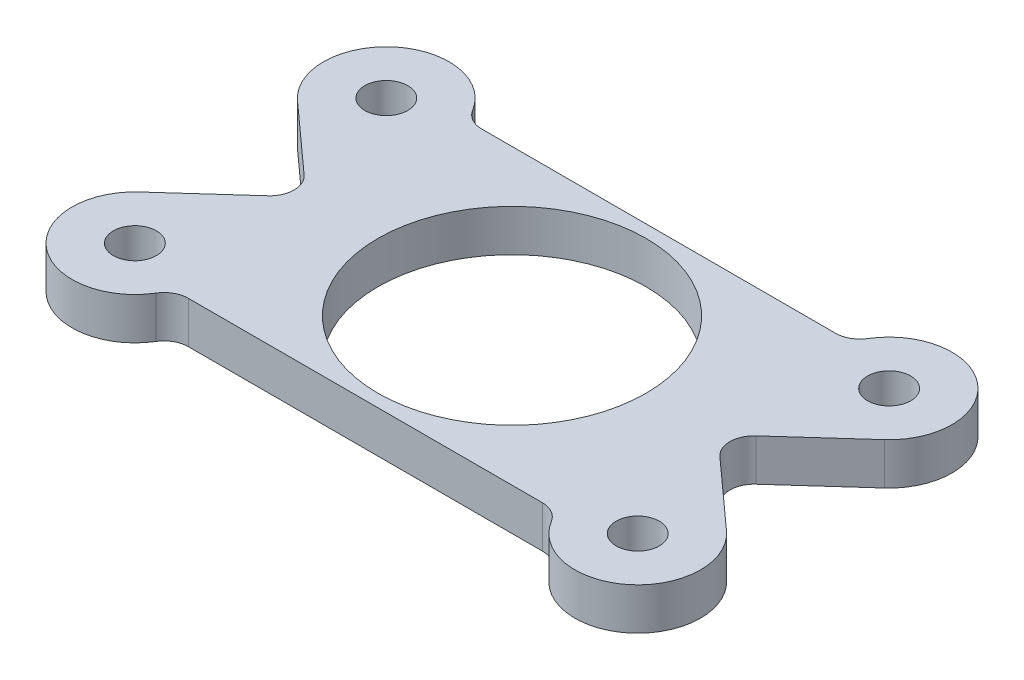
ISO-10303-21;
HEADER;
FILE_DESCRIPTION(('STEP AP214'),'2;1');
FILE_NAME('part.step','',(''),(''),'','','');
FILE_SCHEMA(('AUTOMOTIVE_DESIGN { 1 0 10303 214 1 1 1 1 }'));
ENDSEC;
DATA;
#1=APPLICATION_CONTEXT('core data for automotive mechanical design processes');
#2=APPLICATION_PROTOCOL_DEFINITION('international standard','automotive_design',2000,#1);
#3=PRODUCT_CONTEXT('',#1,'mechanical');
#4=PRODUCT('Part','Part','',(#3));
#5=PRODUCT_RELATED_PRODUCT_CATEGORY('part','',(#4));
#6=PRODUCT_DEFINITION_FORMATION('','',#4);
#7=PRODUCT_DEFINITION_CONTEXT('part definition',#1,'design');
#8=PRODUCT_DEFINITION('design','',#6,#7);
#9=PRODUCT_DEFINITION_SHAPE('','',#8);
#10=(LENGTH_UNIT() NAMED_UNIT(*) SI_UNIT(.MILLI.,.METRE.));
#11=(NAMED_UNIT(*) PLANE_ANGLE_UNIT() SI_UNIT($,.RADIAN.));
#12=(NAMED_UNIT(*) SI_UNIT($,.STERADIAN.) SOLID_ANGLE_UNIT());
#13=UNCERTAINTY_MEASURE_WITH_UNIT(LENGTH_MEASURE(1.E-05),#10,'distance_accuracy_value','');
#14=(GEOMETRIC_REPRESENTATION_CONTEXT(3) GLOBAL_UNCERTAINTY_ASSIGNED_CONTEXT((#13)) GLOBAL_UNIT_ASSIGNED_CONTEXT((#10,
#11,#12)) REPRESENTATION_CONTEXT('',''));
#15=CARTESIAN_POINT('',(0.,0.,0.));
#16=DIRECTION('',(0.,0.,1.));
#17=DIRECTION('',(1.,0.,0.));
#18=AXIS2_PLACEMENT_3D('',#15,#16,#17);
#19=CARTESIAN_POINT('',(19.05,3.175,-9.525));
#20=DIRECTION('',(0.,1.,0.));
#21=DIRECTION('',(0.,0.,1.));
#22=AXIS2_PLACEMENT_3D('',#19,#20,#21);
#23=PLANE('',#22);
#24=CARTESIAN_POINT('',(-19.05,3.175,-9.525));
#25=DIRECTION('',(0.,1.,0.));
#26=DIRECTION('',(0.,0.,1.));
#27=AXIS2_PLACEMENT_3D('',#24,#25,#26);
#28=CIRCLE('',#27,1.63194999999999);
#29=CARTESIAN_POINT('',(-19.05,3.175,-7.89305000000001));
#30=VERTEX_POINT('',#29);
#31=EDGE_CURVE('E393',#30,#30,#28,.T.);
#32=ORIENTED_EDGE('',*,*,#31,.F.);
#33=EDGE_LOOP('',(#32));
#34=FACE_BOUND('',#33,.T.);
#35=CARTESIAN_POINT('',(-19.05,3.175,9.525));
#36=DIRECTION('',(0.,1.,0.));
#37=DIRECTION('',(0.,0.,1.));
#38=AXIS2_PLACEMENT_3D('',#35,#36,#37);
#39=CIRCLE('',#38,1.63194999999999);
#40=CARTESIAN_POINT('',(-19.05,3.175,11.15695));
#41=VERTEX_POINT('',#40);
#42=EDGE_CURVE('E387',#41,#41,#39,.T.);
#43=ORIENTED_EDGE('',*,*,#42,.F.);
#44=EDGE_LOOP('',(#43));
#45=FACE_BOUND('',#44,.T.);
#46=CARTESIAN_POINT('',(19.05,3.175,9.525));
#47=DIRECTION('',(0.,1.,0.));
#48=DIRECTION('',(0.,0.,1.));
#49=AXIS2_PLACEMENT_3D('',#46,#47,#48);
#50=CIRCLE('',#49,1.63194999999999);
#51=CARTESIAN_POINT('',(19.05,3.175,11.15695));
#52=VERTEX_POINT('',#51);
#53=EDGE_CURVE('E381',#52,#52,#50,.T.);
#54=ORIENTED_EDGE('',*,*,#53,.F.);
#55=EDGE_LOOP('',(#54));
#56=FACE_BOUND('',#55,.T.);
#57=CARTESIAN_POINT('',(19.05,3.175,-9.525));
#58=DIRECTION('',(0.,1.,0.));
#59=DIRECTION('',(0.,0.,1.));
#60=AXIS2_PLACEMENT_3D('',#57,#58,#59);
#61=CIRCLE('',#60,1.63194999999999);
#62=CARTESIAN_POINT('',(19.05,3.175,-7.89305000000001));
#63=VERTEX_POINT('',#62);
#64=EDGE_CURVE('E375',#63,#63,#61,.T.);
#65=ORIENTED_EDGE('',*,*,#64,.F.);
#66=EDGE_LOOP('',(#65));
#67=FACE_BOUND('',#66,.T.);
#68=CARTESIAN_POINT('',(19.05,3.175,-9.525));
#69=DIRECTION('',(0.,1.,0.));
#70=DIRECTION('',(0.,0.,1.));
#71=AXIS2_PLACEMENT_3D('',#68,#69,#70);
#72=CIRCLE('',#71,4.7625);
#73=CARTESIAN_POINT('',(22.2403597223853,3.175,-5.98904028702507));
#74=VERTEX_POINT('',#73);
#75=CARTESIAN_POINT('',(14.9798052007245,3.175,-11.9978365384615));
#76=VERTEX_POINT('',#75);
#77=EDGE_CURVE('E217',#74,#76,#72,.T.);
#78=ORIENTED_EDGE('',*,*,#77,.T.);
#79=CARTESIAN_POINT('',(13.4059965450046,3.175,-12.954));
#80=DIRECTION('',(0.,1.,0.));
#81=DIRECTION('',(0.,0.,1.));
#82=AXIS2_PLACEMENT_3D('',#79,#80,#81);
#83=CIRCLE('',#82,1.8415);
#84=CARTESIAN_POINT('',(13.4059965450046,3.175,-11.1125));
#85=VERTEX_POINT('',#84);
#86=EDGE_CURVE('E264',#76,#85,#83,.F.);
#87=ORIENTED_EDGE('',*,*,#86,.T.);
#88=DIRECTION('',(-1.,0.,0.));
#89=VECTOR('',#88,1.);
#90=CARTESIAN_POINT('',(-14.5598719394654,3.175,-11.1125));
#91=LINE('',#90,#89);
#92=CARTESIAN_POINT('',(-13.4059965450046,3.175,-11.1125));
#93=VERTEX_POINT('',#92);
#94=EDGE_CURVE('E152',#85,#93,#91,.T.);
#95=ORIENTED_EDGE('',*,*,#94,.T.);
#96=CARTESIAN_POINT('',(-13.4059965450046,3.175,-12.954));
#97=DIRECTION('',(0.,1.,0.));
#98=DIRECTION('',(0.,0.,1.));
#99=AXIS2_PLACEMENT_3D('',#96,#97,#98);
#100=CIRCLE('',#99,1.8415);
#101=CARTESIAN_POINT('',(-14.9798052007245,3.175,-11.9978365384615));
#102=VERTEX_POINT('',#101);
#103=EDGE_CURVE('E11',#93,#102,#100,.F.);
#104=ORIENTED_EDGE('',*,*,#103,.T.);
#105=CARTESIAN_POINT('',(-19.05,3.175,-9.525));
#106=DIRECTION('',(0.,1.,0.));
#107=DIRECTION('',(0.,0.,1.));
#108=AXIS2_PLACEMENT_3D('',#105,#106,#107);
#109=CIRCLE('',#108,4.7625);
#110=CARTESIAN_POINT('',(-22.2403597223853,3.175,-5.98904028702507));
#111=VERTEX_POINT('',#110);
#112=EDGE_CURVE('E144',#102,#111,#109,.T.);
#113=ORIENTED_EDGE('',*,*,#112,.T.);
#114=DIRECTION('',(0.742458732383186,0.,0.669891805225256));
#115=VECTOR('',#114,1.);
#116=CARTESIAN_POINT('',(-22.2403597223853,3.175,-5.98904028702507));
#117=LINE('',#116,#115);
#118=CARTESIAN_POINT('',(-17.1178942406777,3.175,-1.36723775568364));
#119=VERTEX_POINT('',#118);
#120=EDGE_CURVE('E149',#111,#119,#117,.T.);
#121=ORIENTED_EDGE('',*,*,#120,.T.);
#122=CARTESIAN_POINT('',(-18.3515,3.175,0.));
#123=DIRECTION('',(0.,-1.,0.));
#124=DIRECTION('',(0.,0.,1.));
#125=AXIS2_PLACEMENT_3D('',#122,#123,#124);
#126=CIRCLE('',#125,1.8415);
#127=CARTESIAN_POINT('',(-17.1178942406777,3.175,1.36723775568364));
#128=VERTEX_POINT('',#127);
#129=EDGE_CURVE('E167',#119,#128,#126,.T.);
#130=ORIENTED_EDGE('',*,*,#129,.T.);
#131=DIRECTION('',(-0.742458732383186,0.,0.669891805225257));
#132=VECTOR('',#131,1.);
#133=CARTESIAN_POINT('',(-17.1178942406777,3.175,1.36723775568364));
#134=LINE('',#133,#132);
#135=CARTESIAN_POINT('',(-22.2403597223853,3.175,5.98904028702508));
#136=VERTEX_POINT('',#135);
#137=EDGE_CURVE('E169',#128,#136,#134,.T.);
#138=ORIENTED_EDGE('',*,*,#137,.T.);
#139=CARTESIAN_POINT('',(-19.05,3.175,9.525));
#140=DIRECTION('',(0.,1.,0.));
#141=DIRECTION('',(0.,0.,1.));
#142=AXIS2_PLACEMENT_3D('',#139,#140,#141);
#143=CIRCLE('',#142,4.7625);
#144=CARTESIAN_POINT('',(-14.9798052007245,3.175,11.9978365384615));
#145=VERTEX_POINT('',#144);
#146=EDGE_CURVE('E174',#136,#145,#143,.T.);
#147=ORIENTED_EDGE('',*,*,#146,.T.);
#148=CARTESIAN_POINT('',(-13.4059965450046,3.175,12.954));
#149=DIRECTION('',(0.,1.,0.));
#150=DIRECTION('',(0.,0.,1.));
#151=AXIS2_PLACEMENT_3D('',#148,#149,#150);
#152=CIRCLE('',#151,1.8415);
#153=CARTESIAN_POINT('',(-13.4059965450046,3.175,11.1125));
#154=VERTEX_POINT('',#153);
#155=EDGE_CURVE('E256',#145,#154,#152,.F.);
#156=ORIENTED_EDGE('',*,*,#155,.T.);
#157=DIRECTION('',(1.,0.,0.));
#158=VECTOR('',#157,1.);
#159=CARTESIAN_POINT('',(-14.5598719394654,3.175,11.1125));
#160=LINE('',#159,#158);
#161=CARTESIAN_POINT('',(13.4059965450046,3.175,11.1125));
#162=VERTEX_POINT('',#161);
#163=EDGE_CURVE('E177',#154,#162,#160,.T.);
#164=ORIENTED_EDGE('',*,*,#163,.T.);
#165=CARTESIAN_POINT('',(13.4059965450046,3.175,12.954));
#166=DIRECTION('',(0.,1.,0.));
#167=DIRECTION('',(0.,0.,1.));
#168=AXIS2_PLACEMENT_3D('',#165,#166,#167);
#169=CIRCLE('',#168,1.8415);
#170=CARTESIAN_POINT('',(14.9798052007245,3.175,11.9978365384615));
#171=VERTEX_POINT('',#170);
#172=EDGE_CURVE('E260',#162,#171,#169,.F.);
#173=ORIENTED_EDGE('',*,*,#172,.T.);
#174=CARTESIAN_POINT('',(19.05,3.175,9.525));
#175=DIRECTION('',(0.,1.,0.));
#176=DIRECTION('',(0.,0.,1.));
#177=AXIS2_PLACEMENT_3D('',#174,#175,#176);
#178=CIRCLE('',#177,4.7625);
#179=CARTESIAN_POINT('',(22.2403597223853,3.175,5.98904028702508));
#180=VERTEX_POINT('',#179);
#181=EDGE_CURVE('E180',#171,#180,#178,.T.);
#182=ORIENTED_EDGE('',*,*,#181,.T.);
#183=DIRECTION('',(-0.742458732383186,0.,-0.669891805225257));
#184=VECTOR('',#183,1.);
#185=CARTESIAN_POINT('',(17.1178942406777,3.175,1.36723775568364));
#186=LINE('',#185,#184);
#187=CARTESIAN_POINT('',(17.1178942406777,3.175,1.36723775568364));
#188=VERTEX_POINT('',#187);
#189=EDGE_CURVE('E182',#180,#188,#186,.T.);
#190=ORIENTED_EDGE('',*,*,#189,.T.);
#191=CARTESIAN_POINT('',(18.3515,3.175,0.));
#192=DIRECTION('',(0.,-1.,0.));
#193=DIRECTION('',(0.,0.,-1.));
#194=AXIS2_PLACEMENT_3D('',#191,#192,#193);
#195=CIRCLE('',#194,1.8415);
#196=CARTESIAN_POINT('',(17.1178942406777,3.175,-1.36723775568364));
#197=VERTEX_POINT('',#196);
#198=EDGE_CURVE('E184',#188,#197,#195,.T.);
#199=ORIENTED_EDGE('',*,*,#198,.T.);
#200=DIRECTION('',(0.742458732383186,0.,-0.669891805225256));
#201=VECTOR('',#200,1.);
#202=CARTESIAN_POINT('',(22.2403597223853,3.175,-5.98904028702507));
#203=LINE('',#202,#201);
#204=EDGE_CURVE('E186',#197,#74,#203,.T.);
#205=ORIENTED_EDGE('',*,*,#204,.T.);
#206=EDGE_LOOP('',(#78,#87,#95,#104,#113,#121,#130,#138,#147,#156,#164,#173,#182,#190,#199,#205));
#207=FACE_BOUND('',#206,.T.);
#208=CARTESIAN_POINT('',(0.,3.175,0.));
#209=DIRECTION('',(0.,1.,0.));
#210=DIRECTION('',(0.,0.,1.));
#211=AXIS2_PLACEMENT_3D('',#208,#209,#210);
#212=CIRCLE('',#211,10.16);
#213=CARTESIAN_POINT('',(0.,3.175,10.16));
#214=VERTEX_POINT('',#213);
#215=EDGE_CURVE('E193',#214,#214,#212,.T.);
#216=ORIENTED_EDGE('',*,*,#215,.F.);
#217=EDGE_LOOP('',(#216));
#218=FACE_BOUND('',#217,.T.);
#219=ADVANCED_FACE('F35',(#34,#45,#56,#67,#207,#218),#23,.T.);
#220=CARTESIAN_POINT('',(19.05,0.,-9.525));
#221=DIRECTION('',(0.,1.,0.));
#222=DIRECTION('',(0.,0.,1.));
#223=AXIS2_PLACEMENT_3D('',#220,#221,#222);
#224=PLANE('',#223);
#225=CARTESIAN_POINT('',(-19.05,0.,-9.525));
#226=DIRECTION('',(0.,1.,0.));
#227=DIRECTION('',(0.,0.,1.));
#228=AXIS2_PLACEMENT_3D('',#225,#226,#227);
#229=CIRCLE('',#228,1.63195);
#230=CARTESIAN_POINT('',(-19.05,0.,-7.89305));
#231=VERTEX_POINT('',#230);
#232=EDGE_CURVE('E390',#231,#231,#229,.T.);
#233=ORIENTED_EDGE('',*,*,#232,.T.);
#234=EDGE_LOOP('',(#233));
#235=FACE_BOUND('',#234,.T.);
#236=CARTESIAN_POINT('',(-19.05,0.,9.525));
#237=DIRECTION('',(0.,1.,0.));
#238=DIRECTION('',(0.,0.,1.));
#239=AXIS2_PLACEMENT_3D('',#236,#237,#238);
#240=CIRCLE('',#239,1.63195);
#241=CARTESIAN_POINT('',(-19.05,0.,11.15695));
#242=VERTEX_POINT('',#241);
#243=EDGE_CURVE('E384',#242,#242,#240,.T.);
#244=ORIENTED_EDGE('',*,*,#243,.T.);
#245=EDGE_LOOP('',(#244));
#246=FACE_BOUND('',#245,.T.);
#247=CARTESIAN_POINT('',(19.05,0.,9.525));
#248=DIRECTION('',(0.,1.,0.));
#249=DIRECTION('',(0.,0.,1.));
#250=AXIS2_PLACEMENT_3D('',#247,#248,#249);
#251=CIRCLE('',#250,1.63195);
#252=CARTESIAN_POINT('',(19.05,0.,11.15695));
#253=VERTEX_POINT('',#252);
#254=EDGE_CURVE('E378',#253,#253,#251,.T.);
#255=ORIENTED_EDGE('',*,*,#254,.T.);
#256=EDGE_LOOP('',(#255));
#257=FACE_BOUND('',#256,.T.);
#258=CARTESIAN_POINT('',(19.05,0.,-9.525));
#259=DIRECTION('',(0.,1.,0.));
#260=DIRECTION('',(0.,0.,1.));
#261=AXIS2_PLACEMENT_3D('',#258,#259,#260);
#262=CIRCLE('',#261,1.63195);
#263=CARTESIAN_POINT('',(19.05,0.,-7.89305));
#264=VERTEX_POINT('',#263);
#265=EDGE_CURVE('E370',#264,#264,#262,.T.);
#266=ORIENTED_EDGE('',*,*,#265,.T.);
#267=EDGE_LOOP('',(#266));
#268=FACE_BOUND('',#267,.T.);
#269=CARTESIAN_POINT('',(19.05,0.,-9.525));
#270=DIRECTION('',(0.,1.,0.));
#271=DIRECTION('',(0.,0.,1.));
#272=AXIS2_PLACEMENT_3D('',#269,#270,#271);
#273=CIRCLE('',#272,4.7625);
#274=CARTESIAN_POINT('',(22.2403597223853,0.,-5.98904028702507));
#275=VERTEX_POINT('',#274);
#276=CARTESIAN_POINT('',(14.9798052007245,0.,-11.9978365384615));
#277=VERTEX_POINT('',#276);
#278=EDGE_CURVE('E189',#275,#277,#273,.T.);
#279=ORIENTED_EDGE('',*,*,#278,.F.);
#280=DIRECTION('',(0.742458732383186,0.,-0.669891805225256));
#281=VECTOR('',#280,1.);
#282=CARTESIAN_POINT('',(22.2403597223853,0.,-5.98904028702507));
#283=LINE('',#282,#281);
#284=CARTESIAN_POINT('',(17.1178942406777,0.,-1.36723775568364));
#285=VERTEX_POINT('',#284);
#286=EDGE_CURVE('E215',#285,#275,#283,.T.);
#287=ORIENTED_EDGE('',*,*,#286,.F.);
#288=CARTESIAN_POINT('',(18.3515,0.,0.));
#289=DIRECTION('',(0.,-1.,0.));
#290=DIRECTION('',(0.,0.,-1.));
#291=AXIS2_PLACEMENT_3D('',#288,#289,#290);
#292=CIRCLE('',#291,1.8415);
#293=CARTESIAN_POINT('',(17.1178942406777,0.,1.36723775568364));
#294=VERTEX_POINT('',#293);
#295=EDGE_CURVE('E213',#294,#285,#292,.T.);
#296=ORIENTED_EDGE('',*,*,#295,.F.);
#297=DIRECTION('',(-0.742458732383186,0.,-0.669891805225257));
#298=VECTOR('',#297,1.);
#299=CARTESIAN_POINT('',(17.1178942406777,0.,1.36723775568364));
#300=LINE('',#299,#298);
#301=CARTESIAN_POINT('',(22.2403597223853,0.,5.98904028702508));
#302=VERTEX_POINT('',#301);
#303=EDGE_CURVE('E211',#302,#294,#300,.T.);
#304=ORIENTED_EDGE('',*,*,#303,.F.);
#305=CARTESIAN_POINT('',(19.05,0.,9.525));
#306=DIRECTION('',(0.,1.,0.));
#307=DIRECTION('',(0.,0.,1.));
#308=AXIS2_PLACEMENT_3D('',#305,#306,#307);
#309=CIRCLE('',#308,4.7625);
#310=CARTESIAN_POINT('',(14.9798052007245,0.,11.9978365384615));
#311=VERTEX_POINT('',#310);
#312=EDGE_CURVE('E209',#311,#302,#309,.T.);
#313=ORIENTED_EDGE('',*,*,#312,.F.);
#314=CARTESIAN_POINT('',(13.4059965450046,0.,12.954));
#315=DIRECTION('',(0.,1.,0.));
#316=DIRECTION('',(0.,0.,1.));
#317=AXIS2_PLACEMENT_3D('',#314,#315,#316);
#318=CIRCLE('',#317,1.8415);
#319=CARTESIAN_POINT('',(13.4059965450046,0.,11.1125));
#320=VERTEX_POINT('',#319);
#321=EDGE_CURVE('E258',#311,#320,#318,.T.);
#322=ORIENTED_EDGE('',*,*,#321,.T.);
#323=DIRECTION('',(1.,0.,0.));
#324=VECTOR('',#323,1.);
#325=CARTESIAN_POINT('',(-14.5598719394654,0.,11.1125));
#326=LINE('',#325,#324);
#327=CARTESIAN_POINT('',(-13.4059965450046,0.,11.1125));
#328=VERTEX_POINT('',#327);
#329=EDGE_CURVE('E206',#328,#320,#326,.T.);
#330=ORIENTED_EDGE('',*,*,#329,.F.);
#331=CARTESIAN_POINT('',(-13.4059965450046,0.,12.954));
#332=DIRECTION('',(0.,1.,0.));
#333=DIRECTION('',(0.,0.,1.));
#334=AXIS2_PLACEMENT_3D('',#331,#332,#333);
#335=CIRCLE('',#334,1.8415);
#336=CARTESIAN_POINT('',(-14.9798052007245,0.,11.9978365384615));
#337=VERTEX_POINT('',#336);
#338=EDGE_CURVE('E254',#328,#337,#335,.T.);
#339=ORIENTED_EDGE('',*,*,#338,.T.);
#340=CARTESIAN_POINT('',(-19.05,0.,9.525));
#341=DIRECTION('',(0.,1.,0.));
#342=DIRECTION('',(0.,0.,1.));
#343=AXIS2_PLACEMENT_3D('',#340,#341,#342);
#344=CIRCLE('',#343,4.7625);
#345=CARTESIAN_POINT('',(-22.2403597223853,0.,5.98904028702508));
#346=VERTEX_POINT('',#345);
#347=EDGE_CURVE('E203',#346,#337,#344,.T.);
#348=ORIENTED_EDGE('',*,*,#347,.F.);
#349=DIRECTION('',(-0.742458732383186,0.,0.669891805225257));
#350=VECTOR('',#349,1.);
#351=CARTESIAN_POINT('',(-17.1178942406777,0.,1.36723775568364));
#352=LINE('',#351,#350);
#353=CARTESIAN_POINT('',(-17.1178942406777,0.,1.36723775568364));
#354=VERTEX_POINT('',#353);
#355=EDGE_CURVE('E201',#354,#346,#352,.T.);
#356=ORIENTED_EDGE('',*,*,#355,.F.);
#357=CARTESIAN_POINT('',(-18.3515,0.,0.));
#358=DIRECTION('',(0.,-1.,0.));
#359=DIRECTION('',(0.,0.,1.));
#360=AXIS2_PLACEMENT_3D('',#357,#358,#359);
#361=CIRCLE('',#360,1.8415);
#362=CARTESIAN_POINT('',(-17.1178942406777,0.,-1.36723775568364));
#363=VERTEX_POINT('',#362);
#364=EDGE_CURVE('E199',#363,#354,#361,.T.);
#365=ORIENTED_EDGE('',*,*,#364,.F.);
#366=DIRECTION('',(0.742458732383186,0.,0.669891805225256));
#367=VECTOR('',#366,1.);
#368=CARTESIAN_POINT('',(-22.2403597223853,0.,-5.98904028702507));
#369=LINE('',#368,#367);
#370=CARTESIAN_POINT('',(-22.2403597223853,0.,-5.98904028702507));
#371=VERTEX_POINT('',#370);
#372=EDGE_CURVE('E197',#371,#363,#369,.T.);
#373=ORIENTED_EDGE('',*,*,#372,.F.);
#374=CARTESIAN_POINT('',(-19.05,0.,-9.525));
#375=DIRECTION('',(0.,1.,0.));
#376=DIRECTION('',(0.,0.,1.));
#377=AXIS2_PLACEMENT_3D('',#374,#375,#376);
#378=CIRCLE('',#377,4.7625);
#379=CARTESIAN_POINT('',(-14.9798052007245,0.,-11.9978365384615));
#380=VERTEX_POINT('',#379);
#381=EDGE_CURVE('E158',#380,#371,#378,.T.);
#382=ORIENTED_EDGE('',*,*,#381,.F.);
#383=CARTESIAN_POINT('',(-13.4059965450046,0.,-12.954));
#384=DIRECTION('',(0.,1.,0.));
#385=DIRECTION('',(0.,0.,1.));
#386=AXIS2_PLACEMENT_3D('',#383,#384,#385);
#387=CIRCLE('',#386,1.8415);
#388=CARTESIAN_POINT('',(-13.4059965450046,0.,-11.1125));
#389=VERTEX_POINT('',#388);
#390=EDGE_CURVE('E43',#380,#389,#387,.T.);
#391=ORIENTED_EDGE('',*,*,#390,.T.);
#392=DIRECTION('',(-1.,0.,0.));
#393=VECTOR('',#392,1.);
#394=CARTESIAN_POINT('',(-14.5598719394654,0.,-11.1125));
#395=LINE('',#394,#393);
#396=CARTESIAN_POINT('',(13.4059965450046,0.,-11.1125));
#397=VERTEX_POINT('',#396);
#398=EDGE_CURVE('E192',#397,#389,#395,.T.);
#399=ORIENTED_EDGE('',*,*,#398,.F.);
#400=CARTESIAN_POINT('',(13.4059965450046,0.,-12.954));
#401=DIRECTION('',(0.,1.,0.));
#402=DIRECTION('',(0.,0.,1.));
#403=AXIS2_PLACEMENT_3D('',#400,#401,#402);
#404=CIRCLE('',#403,1.8415);
#405=EDGE_CURVE('E262',#397,#277,#404,.T.);
#406=ORIENTED_EDGE('',*,*,#405,.T.);
#407=EDGE_LOOP('',(#279,#287,#296,#304,#313,#322,#330,#339,#348,#356,#365,#373,#382,#391,#399,#406));
#408=FACE_BOUND('',#407,.T.);
#409=CARTESIAN_POINT('',(0.,0.,0.));
#410=DIRECTION('',(0.,1.,0.));
#411=DIRECTION('',(0.,0.,1.));
#412=AXIS2_PLACEMENT_3D('',#409,#410,#411);
#413=CIRCLE('',#412,10.16);
#414=CARTESIAN_POINT('',(0.,0.,10.16));
#415=VERTEX_POINT('',#414);
#416=EDGE_CURVE('E367',#415,#415,#413,.T.);
#417=ORIENTED_EDGE('',*,*,#416,.T.);
#418=EDGE_LOOP('',(#417));
#419=FACE_BOUND('',#418,.T.);
#420=ADVANCED_FACE('F268',(#235,#246,#257,#268,#408,#419),#224,.F.);
#421=CARTESIAN_POINT('',(19.05,3.175,-9.525));
#422=DIRECTION('',(0.,-1.,0.));
#423=DIRECTION('',(0.,0.,-1.));
#424=AXIS2_PLACEMENT_3D('',#421,#422,#423);
#425=CYLINDRICAL_SURFACE('',#424,4.7625);
#426=ORIENTED_EDGE('',*,*,#278,.T.);
#427=DIRECTION('',(0.,-1.,0.));
#428=VECTOR('',#427,1.);
#429=CARTESIAN_POINT('',(14.9798052007245,3.175,-11.9978365384615));
#430=LINE('',#429,#428);
#431=EDGE_CURVE('E250',#277,#76,#430,.F.);
#432=ORIENTED_EDGE('',*,*,#431,.T.);
#433=ORIENTED_EDGE('',*,*,#77,.F.);
#434=DIRECTION('',(0.,-1.,0.));
#435=VECTOR('',#434,1.);
#436=CARTESIAN_POINT('',(22.2403597223853,3.175,-5.98904028702507));
#437=LINE('',#436,#435);
#438=EDGE_CURVE('E188',#74,#275,#437,.T.);
#439=ORIENTED_EDGE('',*,*,#438,.T.);
#440=EDGE_LOOP('',(#426,#432,#433,#439));
#441=FACE_BOUND('',#440,.T.);
#442=ADVANCED_FACE('F287',(#441),#425,.T.);
#443=CARTESIAN_POINT('',(-14.5598719394654,3.175,-11.1125));
#444=DIRECTION('',(0.,0.,1.));
#445=DIRECTION('',(1.,0.,0.));
#446=AXIS2_PLACEMENT_3D('',#443,#444,#445);
#447=PLANE('',#446);
#448=ORIENTED_EDGE('',*,*,#94,.F.);
#449=DIRECTION('',(0.,1.,0.));
#450=VECTOR('',#449,1.);
#451=CARTESIAN_POINT('',(13.4059965450046,0.,-11.1125));
#452=LINE('',#451,#450);
#453=EDGE_CURVE('E247',#85,#397,#452,.F.);
#454=ORIENTED_EDGE('',*,*,#453,.T.);
#455=ORIENTED_EDGE('',*,*,#398,.T.);
#456=DIRECTION('',(0.,1.,0.));
#457=VECTOR('',#456,1.);
#458=CARTESIAN_POINT('',(-13.4059965450046,3.175,-11.1125));
#459=LINE('',#458,#457);
#460=EDGE_CURVE('E245',#389,#93,#459,.T.);
#461=ORIENTED_EDGE('',*,*,#460,.T.);
#462=EDGE_LOOP('',(#448,#454,#455,#461));
#463=FACE_BOUND('',#462,.T.);
#464=ADVANCED_FACE('F272',(#463),#447,.F.);
#465=CARTESIAN_POINT('',(-19.05,3.175,-9.525));
#466=DIRECTION('',(0.,-1.,0.));
#467=DIRECTION('',(0.,0.,-1.));
#468=AXIS2_PLACEMENT_3D('',#465,#466,#467);
#469=CYLINDRICAL_SURFACE('',#468,4.7625);
#470=ORIENTED_EDGE('',*,*,#112,.F.);
#471=DIRECTION('',(0.,-1.,0.));
#472=VECTOR('',#471,1.);
#473=CARTESIAN_POINT('',(-14.9798052007245,3.175,-11.9978365384615));
#474=LINE('',#473,#472);
#475=EDGE_CURVE('E252',#102,#380,#474,.T.);
#476=ORIENTED_EDGE('',*,*,#475,.T.);
#477=ORIENTED_EDGE('',*,*,#381,.T.);
#478=DIRECTION('',(0.,-1.,0.));
#479=VECTOR('',#478,1.);
#480=CARTESIAN_POINT('',(-22.2403597223853,3.175,-5.98904028702507));
#481=LINE('',#480,#479);
#482=EDGE_CURVE('E155',#111,#371,#481,.T.);
#483=ORIENTED_EDGE('',*,*,#482,.F.);
#484=EDGE_LOOP('',(#470,#476,#477,#483));
#485=FACE_BOUND('',#484,.T.);
#486=ADVANCED_FACE('F156',(#485),#469,.T.);
#487=CARTESIAN_POINT('',(-22.2403597223853,3.175,-5.98904028702507));
#488=DIRECTION('',(0.669891805225256,0.,-0.742458732383186));
#489=DIRECTION('',(-0.742458732383186,0.,-0.669891805225256));
#490=AXIS2_PLACEMENT_3D('',#487,#488,#489);
#491=PLANE('',#490);
#492=ORIENTED_EDGE('',*,*,#372,.T.);
#493=DIRECTION('',(0.,-1.,0.));
#494=VECTOR('',#493,1.);
#495=CARTESIAN_POINT('',(-17.1178942406777,3.175,-1.36723775568364));
#496=LINE('',#495,#494);
#497=EDGE_CURVE('E162',#119,#363,#496,.T.);
#498=ORIENTED_EDGE('',*,*,#497,.F.);
#499=ORIENTED_EDGE('',*,*,#120,.F.);
#500=ORIENTED_EDGE('',*,*,#482,.T.);
#501=EDGE_LOOP('',(#492,#498,#499,#500));
#502=FACE_BOUND('',#501,.T.);
#503=ADVANCED_FACE('F164',(#502),#491,.F.);
#504=CARTESIAN_POINT('',(-18.3515,3.175,0.));
#505=DIRECTION('',(0.,-1.,0.));
#506=DIRECTION('',(0.,0.,-1.));
#507=AXIS2_PLACEMENT_3D('',#504,#505,#506);
#508=CYLINDRICAL_SURFACE('',#507,1.8415);
#509=ORIENTED_EDGE('',*,*,#364,.T.);
#510=DIRECTION('',(0.,-1.,0.));
#511=VECTOR('',#510,1.);
#512=CARTESIAN_POINT('',(-17.1178942406777,3.175,1.36723775568364));
#513=LINE('',#512,#511);
#514=EDGE_CURVE('E232',#128,#354,#513,.T.);
#515=ORIENTED_EDGE('',*,*,#514,.F.);
#516=ORIENTED_EDGE('',*,*,#129,.F.);
#517=ORIENTED_EDGE('',*,*,#497,.T.);
#518=EDGE_LOOP('',(#509,#515,#516,#517));
#519=FACE_BOUND('',#518,.T.);
#520=ADVANCED_FACE('F323',(#519),#508,.F.);
#521=CARTESIAN_POINT('',(-17.1178942406777,3.175,1.36723775568364));
#522=DIRECTION('',(0.669891805225257,0.,0.742458732383185));
#523=DIRECTION('',(0.742458732383186,0.,-0.669891805225257));
#524=AXIS2_PLACEMENT_3D('',#521,#522,#523);
#525=PLANE('',#524);
#526=ORIENTED_EDGE('',*,*,#355,.T.);
#527=DIRECTION('',(0.,-1.,0.));
#528=VECTOR('',#527,1.);
#529=CARTESIAN_POINT('',(-22.2403597223853,3.175,5.98904028702508));
#530=LINE('',#529,#528);
#531=EDGE_CURVE('E229',#136,#346,#530,.T.);
#532=ORIENTED_EDGE('',*,*,#531,.F.);
#533=ORIENTED_EDGE('',*,*,#137,.F.);
#534=ORIENTED_EDGE('',*,*,#514,.T.);
#535=EDGE_LOOP('',(#526,#532,#533,#534));
#536=FACE_BOUND('',#535,.T.);
#537=ADVANCED_FACE('F319',(#536),#525,.F.);
#538=CARTESIAN_POINT('',(-19.05,3.175,9.525));
#539=DIRECTION('',(0.,-1.,0.));
#540=DIRECTION('',(0.,0.,-1.));
#541=AXIS2_PLACEMENT_3D('',#538,#539,#540);
#542=CYLINDRICAL_SURFACE('',#541,4.7625);
#543=ORIENTED_EDGE('',*,*,#347,.T.);
#544=DIRECTION('',(0.,-1.,0.));
#545=VECTOR('',#544,1.);
#546=CARTESIAN_POINT('',(-14.9798052007245,3.175,11.9978365384615));
#547=LINE('',#546,#545);
#548=EDGE_CURVE('E240',#337,#145,#547,.F.);
#549=ORIENTED_EDGE('',*,*,#548,.T.);
#550=ORIENTED_EDGE('',*,*,#146,.F.);
#551=ORIENTED_EDGE('',*,*,#531,.T.);
#552=EDGE_LOOP('',(#543,#549,#550,#551));
#553=FACE_BOUND('',#552,.T.);
#554=ADVANCED_FACE('F315',(#553),#542,.T.);
#555=CARTESIAN_POINT('',(-14.5598719394654,3.175,11.1125));
#556=DIRECTION('',(0.,0.,-1.));
#557=DIRECTION('',(-1.,0.,0.));
#558=AXIS2_PLACEMENT_3D('',#555,#556,#557);
#559=PLANE('',#558);
#560=ORIENTED_EDGE('',*,*,#163,.F.);
#561=DIRECTION('',(0.,1.,0.));
#562=VECTOR('',#561,1.);
#563=CARTESIAN_POINT('',(-13.4059965450046,0.,11.1125));
#564=LINE('',#563,#562);
#565=EDGE_CURVE('E237',#154,#328,#564,.F.);
#566=ORIENTED_EDGE('',*,*,#565,.T.);
#567=ORIENTED_EDGE('',*,*,#329,.T.);
#568=DIRECTION('',(0.,1.,0.));
#569=VECTOR('',#568,1.);
#570=CARTESIAN_POINT('',(13.4059965450046,3.175,11.1125));
#571=LINE('',#570,#569);
#572=EDGE_CURVE('E161',#320,#162,#571,.T.);
#573=ORIENTED_EDGE('',*,*,#572,.T.);
#574=EDGE_LOOP('',(#560,#566,#567,#573));
#575=FACE_BOUND('',#574,.T.);
#576=ADVANCED_FACE('F311',(#575),#559,.F.);
#577=CARTESIAN_POINT('',(19.05,3.175,9.525));
#578=DIRECTION('',(0.,-1.,0.));
#579=DIRECTION('',(0.,0.,-1.));
#580=AXIS2_PLACEMENT_3D('',#577,#578,#579);
#581=CYLINDRICAL_SURFACE('',#580,4.7625);
#582=ORIENTED_EDGE('',*,*,#181,.F.);
#583=DIRECTION('',(0.,-1.,0.));
#584=VECTOR('',#583,1.);
#585=CARTESIAN_POINT('',(14.9798052007245,3.175,11.9978365384615));
#586=LINE('',#585,#584);
#587=EDGE_CURVE('E242',#171,#311,#586,.T.);
#588=ORIENTED_EDGE('',*,*,#587,.T.);
#589=ORIENTED_EDGE('',*,*,#312,.T.);
#590=DIRECTION('',(0.,-1.,0.));
#591=VECTOR('',#590,1.);
#592=CARTESIAN_POINT('',(22.2403597223853,3.175,5.98904028702508));
#593=LINE('',#592,#591);
#594=EDGE_CURVE('E226',#180,#302,#593,.T.);
#595=ORIENTED_EDGE('',*,*,#594,.F.);
#596=EDGE_LOOP('',(#582,#588,#589,#595));
#597=FACE_BOUND('',#596,.T.);
#598=ADVANCED_FACE('F307',(#597),#581,.T.);
#599=CARTESIAN_POINT('',(17.1178942406777,3.175,1.36723775568364));
#600=DIRECTION('',(-0.669891805225257,0.,0.742458732383185));
#601=DIRECTION('',(0.742458732383186,0.,0.669891805225257));
#602=AXIS2_PLACEMENT_3D('',#599,#600,#601);
#603=PLANE('',#602);
#604=ORIENTED_EDGE('',*,*,#303,.T.);
#605=DIRECTION('',(0.,-1.,0.));
#606=VECTOR('',#605,1.);
#607=CARTESIAN_POINT('',(17.1178942406777,3.175,1.36723775568364));
#608=LINE('',#607,#606);
#609=EDGE_CURVE('E223',#188,#294,#608,.T.);
#610=ORIENTED_EDGE('',*,*,#609,.F.);
#611=ORIENTED_EDGE('',*,*,#189,.F.);
#612=ORIENTED_EDGE('',*,*,#594,.T.);
#613=EDGE_LOOP('',(#604,#610,#611,#612));
#614=FACE_BOUND('',#613,.T.);
#615=ADVANCED_FACE('F303',(#614),#603,.F.);
#616=CARTESIAN_POINT('',(18.3515,3.175,0.));
#617=DIRECTION('',(0.,-1.,0.));
#618=DIRECTION('',(0.,0.,-1.));
#619=AXIS2_PLACEMENT_3D('',#616,#617,#618);
#620=CYLINDRICAL_SURFACE('',#619,1.8415);
#621=ORIENTED_EDGE('',*,*,#295,.T.);
#622=DIRECTION('',(0.,-1.,0.));
#623=VECTOR('',#622,1.);
#624=CARTESIAN_POINT('',(17.1178942406777,3.175,-1.36723775568364));
#625=LINE('',#624,#623);
#626=EDGE_CURVE('E220',#197,#285,#625,.T.);
#627=ORIENTED_EDGE('',*,*,#626,.F.);
#628=ORIENTED_EDGE('',*,*,#198,.F.);
#629=ORIENTED_EDGE('',*,*,#609,.T.);
#630=EDGE_LOOP('',(#621,#627,#628,#629));
#631=FACE_BOUND('',#630,.T.);
#632=ADVANCED_FACE('F299',(#631),#620,.F.);
#633=CARTESIAN_POINT('',(22.2403597223853,3.175,-5.98904028702507));
#634=DIRECTION('',(-0.669891805225256,0.,-0.742458732383186));
#635=DIRECTION('',(-0.742458732383186,0.,0.669891805225256));
#636=AXIS2_PLACEMENT_3D('',#633,#634,#635);
#637=PLANE('',#636);
#638=ORIENTED_EDGE('',*,*,#286,.T.);
#639=ORIENTED_EDGE('',*,*,#438,.F.);
#640=ORIENTED_EDGE('',*,*,#204,.F.);
#641=ORIENTED_EDGE('',*,*,#626,.T.);
#642=EDGE_LOOP('',(#638,#639,#640,#641));
#643=FACE_BOUND('',#642,.T.);
#644=ADVANCED_FACE('F296',(#643),#637,.F.);
#645=CARTESIAN_POINT('',(0.,3.175,0.));
#646=DIRECTION('',(0.,-1.,0.));
#647=DIRECTION('',(0.,0.,-1.));
#648=AXIS2_PLACEMENT_3D('',#645,#646,#647);
#649=CYLINDRICAL_SURFACE('',#648,10.16);
#650=ORIENTED_EDGE('',*,*,#215,.T.);
#651=EDGE_LOOP('',(#650));
#652=FACE_BOUND('',#651,.T.);
#653=ORIENTED_EDGE('',*,*,#416,.F.);
#654=EDGE_LOOP('',(#653));
#655=FACE_BOUND('',#654,.T.);
#656=ADVANCED_FACE('F293',(#652,#655),#649,.F.);
#657=CARTESIAN_POINT('',(19.05,3.175,-9.525));
#658=DIRECTION('',(0.,1.,0.));
#659=DIRECTION('',(0.,0.,1.));
#660=AXIS2_PLACEMENT_3D('',#657,#658,#659);
#661=CYLINDRICAL_SURFACE('',#660,1.63194999999999);
#662=ORIENTED_EDGE('',*,*,#265,.F.);
#663=EDGE_LOOP('',(#662));
#664=FACE_BOUND('',#663,.T.);
#665=ORIENTED_EDGE('',*,*,#64,.T.);
#666=EDGE_LOOP('',(#665));
#667=FACE_BOUND('',#666,.T.);
#668=ADVANCED_FACE('F409',(#664,#667),#661,.F.);
#669=CARTESIAN_POINT('',(19.05,3.175,9.525));
#670=DIRECTION('',(0.,1.,0.));
#671=DIRECTION('',(0.,0.,1.));
#672=AXIS2_PLACEMENT_3D('',#669,#670,#671);
#673=CYLINDRICAL_SURFACE('',#672,1.63194999999999);
#674=ORIENTED_EDGE('',*,*,#254,.F.);
#675=EDGE_LOOP('',(#674));
#676=FACE_BOUND('',#675,.T.);
#677=ORIENTED_EDGE('',*,*,#53,.T.);
#678=EDGE_LOOP('',(#677));
#679=FACE_BOUND('',#678,.T.);
#680=ADVANCED_FACE('F403',(#676,#679),#673,.F.);
#681=CARTESIAN_POINT('',(-19.05,3.175,9.525));
#682=DIRECTION('',(0.,1.,0.));
#683=DIRECTION('',(0.,0.,1.));
#684=AXIS2_PLACEMENT_3D('',#681,#682,#683);
#685=CYLINDRICAL_SURFACE('',#684,1.63194999999999);
#686=ORIENTED_EDGE('',*,*,#243,.F.);
#687=EDGE_LOOP('',(#686));
#688=FACE_BOUND('',#687,.T.);
#689=ORIENTED_EDGE('',*,*,#42,.T.);
#690=EDGE_LOOP('',(#689));
#691=FACE_BOUND('',#690,.T.);
#692=ADVANCED_FACE('F397',(#688,#691),#685,.F.);
#693=CARTESIAN_POINT('',(-19.05,3.175,-9.525));
#694=DIRECTION('',(0.,1.,0.));
#695=DIRECTION('',(0.,0.,1.));
#696=AXIS2_PLACEMENT_3D('',#693,#694,#695);
#697=CYLINDRICAL_SURFACE('',#696,1.63194999999999);
#698=ORIENTED_EDGE('',*,*,#232,.F.);
#699=EDGE_LOOP('',(#698));
#700=FACE_BOUND('',#699,.T.);
#701=ORIENTED_EDGE('',*,*,#31,.T.);
#702=EDGE_LOOP('',(#701));
#703=FACE_BOUND('',#702,.T.);
#704=ADVANCED_FACE('F340',(#700,#703),#697,.F.);
#705=CARTESIAN_POINT('',(-13.4059965450046,3.175,12.954));
#706=DIRECTION('',(0.,-1.,0.));
#707=DIRECTION('',(0.,0.,-1.));
#708=AXIS2_PLACEMENT_3D('',#705,#706,#707);
#709=CYLINDRICAL_SURFACE('',#708,1.8415);
#710=ORIENTED_EDGE('',*,*,#155,.F.);
#711=ORIENTED_EDGE('',*,*,#548,.F.);
#712=ORIENTED_EDGE('',*,*,#338,.F.);
#713=ORIENTED_EDGE('',*,*,#565,.F.);
#714=EDGE_LOOP('',(#710,#711,#712,#713));
#715=FACE_BOUND('',#714,.T.);
#716=ADVANCED_FACE('F337',(#715),#709,.F.);
#717=CARTESIAN_POINT('',(13.4059965450046,3.175,12.954));
#718=DIRECTION('',(0.,-1.,0.));
#719=DIRECTION('',(0.,0.,-1.));
#720=AXIS2_PLACEMENT_3D('',#717,#718,#719);
#721=CYLINDRICAL_SURFACE('',#720,1.8415);
#722=ORIENTED_EDGE('',*,*,#172,.F.);
#723=ORIENTED_EDGE('',*,*,#572,.F.);
#724=ORIENTED_EDGE('',*,*,#321,.F.);
#725=ORIENTED_EDGE('',*,*,#587,.F.);
#726=EDGE_LOOP('',(#722,#723,#724,#725));
#727=FACE_BOUND('',#726,.T.);
#728=ADVANCED_FACE('F279',(#727),#721,.F.);
#729=CARTESIAN_POINT('',(13.4059965450046,3.175,-12.954));
#730=DIRECTION('',(0.,-1.,0.));
#731=DIRECTION('',(0.,0.,-1.));
#732=AXIS2_PLACEMENT_3D('',#729,#730,#731);
#733=CYLINDRICAL_SURFACE('',#732,1.8415);
#734=ORIENTED_EDGE('',*,*,#86,.F.);
#735=ORIENTED_EDGE('',*,*,#431,.F.);
#736=ORIENTED_EDGE('',*,*,#405,.F.);
#737=ORIENTED_EDGE('',*,*,#453,.F.);
#738=EDGE_LOOP('',(#734,#735,#736,#737));
#739=FACE_BOUND('',#738,.T.);
#740=ADVANCED_FACE('F275',(#739),#733,.F.);
#741=CARTESIAN_POINT('',(-13.4059965450046,3.175,-12.954));
#742=DIRECTION('',(0.,-1.,0.));
#743=DIRECTION('',(0.,0.,-1.));
#744=AXIS2_PLACEMENT_3D('',#741,#742,#743);
#745=CYLINDRICAL_SURFACE('',#744,1.8415);
#746=ORIENTED_EDGE('',*,*,#103,.F.);
#747=ORIENTED_EDGE('',*,*,#460,.F.);
#748=ORIENTED_EDGE('',*,*,#390,.F.);
#749=ORIENTED_EDGE('',*,*,#475,.F.);
#750=EDGE_LOOP('',(#746,#747,#748,#749));
#751=FACE_BOUND('',#750,.T.);
#752=ADVANCED_FACE('F37',(#751),#745,.F.);
#753=CLOSED_SHELL('',(#219,#420,#442,#464,#486,#503,#520,#537,#554,#576,#598,#615,#632,#644,
#656,#668,#680,#692,#704,#716,#728,#740,#752));
#754=MANIFOLD_SOLID_BREP('B2',#753);
#755=ADVANCED_BREP_SHAPE_REPRESENTATION('',(#18,#754),#14);
#756=SHAPE_DEFINITION_REPRESENTATION(#9,#755);
ENDSEC;
END-ISO-10303-21;
